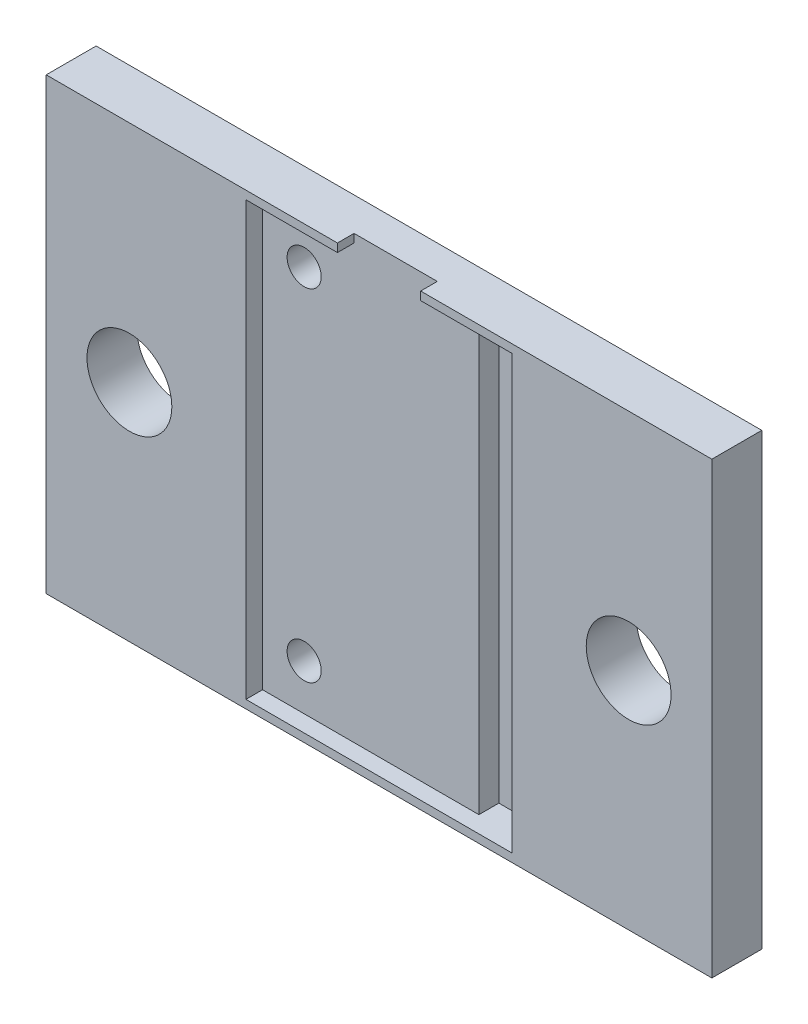
ISO-10303-21;
HEADER;
FILE_DESCRIPTION(('STEP AP214'),'2;1');
FILE_NAME('part.step','',(''),(''),'','','');
FILE_SCHEMA(('AUTOMOTIVE_DESIGN { 1 0 10303 214 1 1 1 1 }'));
ENDSEC;
DATA;
#1=APPLICATION_CONTEXT('core data for automotive mechanical design processes');
#2=APPLICATION_PROTOCOL_DEFINITION('international standard','automotive_design',2000,#1);
#3=PRODUCT_CONTEXT('',#1,'mechanical');
#4=PRODUCT('Part','Part','',(#3));
#5=PRODUCT_RELATED_PRODUCT_CATEGORY('part','',(#4));
#6=PRODUCT_DEFINITION_FORMATION('','',#4);
#7=PRODUCT_DEFINITION_CONTEXT('part definition',#1,'design');
#8=PRODUCT_DEFINITION('design','',#6,#7);
#9=PRODUCT_DEFINITION_SHAPE('','',#8);
#10=(LENGTH_UNIT() NAMED_UNIT(*) SI_UNIT(.MILLI.,.METRE.));
#11=(NAMED_UNIT(*) PLANE_ANGLE_UNIT() SI_UNIT($,.RADIAN.));
#12=(NAMED_UNIT(*) SI_UNIT($,.STERADIAN.) SOLID_ANGLE_UNIT());
#13=UNCERTAINTY_MEASURE_WITH_UNIT(LENGTH_MEASURE(1.E-05),#10,'distance_accuracy_value','');
#14=(GEOMETRIC_REPRESENTATION_CONTEXT(3) GLOBAL_UNCERTAINTY_ASSIGNED_CONTEXT((#13)) GLOBAL_UNIT_ASSIGNED_CONTEXT((#10,
#11,#12)) REPRESENTATION_CONTEXT('',''));
#15=CARTESIAN_POINT('',(0.,0.,0.));
#16=DIRECTION('',(0.,0.,1.));
#17=DIRECTION('',(1.,0.,0.));
#18=AXIS2_PLACEMENT_3D('',#15,#16,#17);
#19=CARTESIAN_POINT('',(0.,0.,3.));
#20=DIRECTION('',(0.,0.,-1.));
#21=DIRECTION('',(-1.,0.,0.));
#22=AXIS2_PLACEMENT_3D('',#19,#20,#21);
#23=PLANE('',#22);
#24=DIRECTION('',(-1.,0.,0.));
#25=VECTOR('',#24,1.);
#26=CARTESIAN_POINT('',(-8.,13.,3.));
#27=LINE('',#26,#25);
#28=CARTESIAN_POINT('',(-2.5,13.,3.));
#29=VERTEX_POINT('',#28);
#30=CARTESIAN_POINT('',(-8.,13.,3.));
#31=VERTEX_POINT('',#30);
#32=EDGE_CURVE('E235',#29,#31,#27,.T.);
#33=ORIENTED_EDGE('',*,*,#32,.F.);
#34=DIRECTION('',(0.,-1.,0.));
#35=VECTOR('',#34,1.);
#36=CARTESIAN_POINT('',(-2.5,13.,3.));
#37=LINE('',#36,#35);
#38=CARTESIAN_POINT('',(-2.5,13.5,3.));
#39=VERTEX_POINT('',#38);
#40=EDGE_CURVE('E231',#39,#29,#37,.T.);
#41=ORIENTED_EDGE('',*,*,#40,.F.);
#42=DIRECTION('',(-1.,0.,0.));
#43=VECTOR('',#42,1.);
#44=CARTESIAN_POINT('',(-20.,13.5,3.));
#45=LINE('',#44,#43);
#46=CARTESIAN_POINT('',(-20.,13.5,3.));
#47=VERTEX_POINT('',#46);
#48=EDGE_CURVE('E287',#39,#47,#45,.T.);
#49=ORIENTED_EDGE('',*,*,#48,.T.);
#50=DIRECTION('',(0.,-1.,0.));
#51=VECTOR('',#50,1.);
#52=CARTESIAN_POINT('',(-20.,-13.5,3.));
#53=LINE('',#52,#51);
#54=CARTESIAN_POINT('',(-20.,-13.5,3.));
#55=VERTEX_POINT('',#54);
#56=EDGE_CURVE('E290',#47,#55,#53,.T.);
#57=ORIENTED_EDGE('',*,*,#56,.T.);
#58=DIRECTION('',(1.,0.,0.));
#59=VECTOR('',#58,1.);
#60=CARTESIAN_POINT('',(-20.,-13.5,3.));
#61=LINE('',#60,#59);
#62=CARTESIAN_POINT('',(20.,-13.5,3.));
#63=VERTEX_POINT('',#62);
#64=EDGE_CURVE('E64',#55,#63,#61,.T.);
#65=ORIENTED_EDGE('',*,*,#64,.T.);
#66=DIRECTION('',(0.,1.,0.));
#67=VECTOR('',#66,1.);
#68=CARTESIAN_POINT('',(20.,-13.5,3.));
#69=LINE('',#68,#67);
#70=CARTESIAN_POINT('',(20.,13.5,3.));
#71=VERTEX_POINT('',#70);
#72=EDGE_CURVE('E284',#63,#71,#69,.T.);
#73=ORIENTED_EDGE('',*,*,#72,.T.);
#74=CARTESIAN_POINT('',(2.5,13.5,3.));
#75=VERTEX_POINT('',#74);
#76=EDGE_CURVE('E92',#71,#75,#45,.T.);
#77=ORIENTED_EDGE('',*,*,#76,.T.);
#78=DIRECTION('',(0.,1.,0.));
#79=VECTOR('',#78,1.);
#80=CARTESIAN_POINT('',(2.5,13.5,3.));
#81=LINE('',#80,#79);
#82=CARTESIAN_POINT('',(2.5,13.,3.));
#83=VERTEX_POINT('',#82);
#84=EDGE_CURVE('E228',#83,#75,#81,.T.);
#85=ORIENTED_EDGE('',*,*,#84,.F.);
#86=DIRECTION('',(-1.,0.,0.));
#87=VECTOR('',#86,1.);
#88=CARTESIAN_POINT('',(2.5,13.,3.));
#89=LINE('',#88,#87);
#90=CARTESIAN_POINT('',(8.,13.,3.));
#91=VERTEX_POINT('',#90);
#92=EDGE_CURVE('E198',#91,#83,#89,.T.);
#93=ORIENTED_EDGE('',*,*,#92,.F.);
#94=DIRECTION('',(0.,1.,0.));
#95=VECTOR('',#94,1.);
#96=CARTESIAN_POINT('',(8.,-13.,3.));
#97=LINE('',#96,#95);
#98=CARTESIAN_POINT('',(8.,-13.,3.));
#99=VERTEX_POINT('',#98);
#100=EDGE_CURVE('E159',#99,#91,#97,.T.);
#101=ORIENTED_EDGE('',*,*,#100,.F.);
#102=DIRECTION('',(1.,0.,0.));
#103=VECTOR('',#102,1.);
#104=CARTESIAN_POINT('',(-8.,-13.,3.));
#105=LINE('',#104,#103);
#106=CARTESIAN_POINT('',(-8.,-13.,3.));
#107=VERTEX_POINT('',#106);
#108=EDGE_CURVE('E243',#107,#99,#105,.T.);
#109=ORIENTED_EDGE('',*,*,#108,.F.);
#110=DIRECTION('',(0.,-1.,0.));
#111=VECTOR('',#110,1.);
#112=CARTESIAN_POINT('',(-8.,13.,3.));
#113=LINE('',#112,#111);
#114=EDGE_CURVE('E239',#31,#107,#113,.T.);
#115=ORIENTED_EDGE('',*,*,#114,.F.);
#116=EDGE_LOOP('',(#33,#41,#49,#57,#65,#73,#77,#85,#93,#101,#109,#115));
#117=FACE_BOUND('',#116,.T.);
#118=CARTESIAN_POINT('',(-15.,0.,3.));
#119=DIRECTION('',(0.,0.,1.));
#120=DIRECTION('',(1.,0.,0.));
#121=AXIS2_PLACEMENT_3D('',#118,#119,#120);
#122=CIRCLE('',#121,2.55);
#123=CARTESIAN_POINT('',(-12.45,0.,3.));
#124=VERTEX_POINT('',#123);
#125=EDGE_CURVE('E276',#124,#124,#122,.T.);
#126=ORIENTED_EDGE('',*,*,#125,.F.);
#127=EDGE_LOOP('',(#126));
#128=FACE_BOUND('',#127,.T.);
#129=CARTESIAN_POINT('',(15.,0.,3.));
#130=DIRECTION('',(0.,0.,1.));
#131=DIRECTION('',(-1.,0.,0.));
#132=AXIS2_PLACEMENT_3D('',#129,#130,#131);
#133=CIRCLE('',#132,2.55);
#134=CARTESIAN_POINT('',(12.45,0.,3.));
#135=VERTEX_POINT('',#134);
#136=EDGE_CURVE('E268',#135,#135,#133,.T.);
#137=ORIENTED_EDGE('',*,*,#136,.F.);
#138=EDGE_LOOP('',(#137));
#139=FACE_BOUND('',#138,.T.);
#140=ADVANCED_FACE('F39',(#117,#128,#139),#23,.F.);
#141=CARTESIAN_POINT('',(0.,0.,0.));
#142=DIRECTION('',(0.,0.,-1.));
#143=DIRECTION('',(-1.,0.,0.));
#144=AXIS2_PLACEMENT_3D('',#141,#142,#143);
#145=PLANE('',#144);
#146=CARTESIAN_POINT('',(-5.5,10.25,0.));
#147=DIRECTION('',(0.,0.,-1.));
#148=DIRECTION('',(-1.,0.,0.));
#149=AXIS2_PLACEMENT_3D('',#146,#147,#148);
#150=CIRCLE('',#149,1.025);
#151=CARTESIAN_POINT('',(-6.525,10.25,0.));
#152=VERTEX_POINT('',#151);
#153=EDGE_CURVE('E186',#152,#152,#150,.T.);
#154=ORIENTED_EDGE('',*,*,#153,.F.);
#155=EDGE_LOOP('',(#154));
#156=FACE_BOUND('',#155,.T.);
#157=CARTESIAN_POINT('',(-5.5,-10.25,0.));
#158=DIRECTION('',(0.,0.,-1.));
#159=DIRECTION('',(-1.,0.,0.));
#160=AXIS2_PLACEMENT_3D('',#157,#158,#159);
#161=CIRCLE('',#160,1.025);
#162=CARTESIAN_POINT('',(-6.525,-10.25,0.));
#163=VERTEX_POINT('',#162);
#164=EDGE_CURVE('E403',#163,#163,#161,.T.);
#165=ORIENTED_EDGE('',*,*,#164,.F.);
#166=EDGE_LOOP('',(#165));
#167=FACE_BOUND('',#166,.T.);
#168=CARTESIAN_POINT('',(-15.,0.,0.));
#169=DIRECTION('',(0.,0.,1.));
#170=DIRECTION('',(1.,0.,0.));
#171=AXIS2_PLACEMENT_3D('',#168,#169,#170);
#172=CIRCLE('',#171,2.55);
#173=CARTESIAN_POINT('',(-12.45,0.,0.));
#174=VERTEX_POINT('',#173);
#175=EDGE_CURVE('E272',#174,#174,#172,.T.);
#176=ORIENTED_EDGE('',*,*,#175,.T.);
#177=EDGE_LOOP('',(#176));
#178=FACE_BOUND('',#177,.T.);
#179=DIRECTION('',(0.,1.,0.));
#180=VECTOR('',#179,1.);
#181=CARTESIAN_POINT('',(20.,-13.5,0.));
#182=LINE('',#181,#180);
#183=CARTESIAN_POINT('',(20.,-13.5,0.));
#184=VERTEX_POINT('',#183);
#185=CARTESIAN_POINT('',(20.,13.5,0.));
#186=VERTEX_POINT('',#185);
#187=EDGE_CURVE('E280',#184,#186,#182,.T.);
#188=ORIENTED_EDGE('',*,*,#187,.F.);
#189=DIRECTION('',(1.,0.,0.));
#190=VECTOR('',#189,1.);
#191=CARTESIAN_POINT('',(-20.,-13.5,0.));
#192=LINE('',#191,#190);
#193=CARTESIAN_POINT('',(-20.,-13.5,0.));
#194=VERTEX_POINT('',#193);
#195=EDGE_CURVE('E85',#194,#184,#192,.T.);
#196=ORIENTED_EDGE('',*,*,#195,.F.);
#197=DIRECTION('',(0.,-1.,0.));
#198=VECTOR('',#197,1.);
#199=CARTESIAN_POINT('',(-20.,-13.5,0.));
#200=LINE('',#199,#198);
#201=CARTESIAN_POINT('',(-20.,13.5,0.));
#202=VERTEX_POINT('',#201);
#203=EDGE_CURVE('E302',#202,#194,#200,.T.);
#204=ORIENTED_EDGE('',*,*,#203,.F.);
#205=DIRECTION('',(-1.,0.,0.));
#206=VECTOR('',#205,1.);
#207=CARTESIAN_POINT('',(-20.,13.5,0.));
#208=LINE('',#207,#206);
#209=EDGE_CURVE('E299',#186,#202,#208,.T.);
#210=ORIENTED_EDGE('',*,*,#209,.F.);
#211=EDGE_LOOP('',(#188,#196,#204,#210));
#212=FACE_BOUND('',#211,.T.);
#213=CARTESIAN_POINT('',(15.,0.,0.));
#214=DIRECTION('',(0.,0.,1.));
#215=DIRECTION('',(-1.,0.,0.));
#216=AXIS2_PLACEMENT_3D('',#213,#214,#215);
#217=CIRCLE('',#216,2.55);
#218=CARTESIAN_POINT('',(12.45,0.,0.));
#219=VERTEX_POINT('',#218);
#220=EDGE_CURVE('E164',#219,#219,#217,.T.);
#221=ORIENTED_EDGE('',*,*,#220,.T.);
#222=EDGE_LOOP('',(#221));
#223=FACE_BOUND('',#222,.T.);
#224=ADVANCED_FACE('F322',(#156,#167,#178,#212,#223),#145,.T.);
#225=CARTESIAN_POINT('',(20.,-13.5,3.));
#226=DIRECTION('',(-1.,0.,0.));
#227=DIRECTION('',(0.,0.,1.));
#228=AXIS2_PLACEMENT_3D('',#225,#226,#227);
#229=PLANE('',#228);
#230=ORIENTED_EDGE('',*,*,#187,.T.);
#231=DIRECTION('',(0.,0.,-1.));
#232=VECTOR('',#231,1.);
#233=CARTESIAN_POINT('',(20.,13.5,3.));
#234=LINE('',#233,#232);
#235=EDGE_CURVE('E11',#71,#186,#234,.T.);
#236=ORIENTED_EDGE('',*,*,#235,.F.);
#237=ORIENTED_EDGE('',*,*,#72,.F.);
#238=DIRECTION('',(0.,0.,-1.));
#239=VECTOR('',#238,1.);
#240=CARTESIAN_POINT('',(20.,-13.5,3.));
#241=LINE('',#240,#239);
#242=EDGE_CURVE('E295',#63,#184,#241,.T.);
#243=ORIENTED_EDGE('',*,*,#242,.T.);
#244=EDGE_LOOP('',(#230,#236,#237,#243));
#245=FACE_BOUND('',#244,.T.);
#246=ADVANCED_FACE('F41',(#245),#229,.F.);
#247=CARTESIAN_POINT('',(-20.,13.5,3.));
#248=DIRECTION('',(0.,-1.,0.));
#249=DIRECTION('',(0.,0.,-1.));
#250=AXIS2_PLACEMENT_3D('',#247,#248,#249);
#251=PLANE('',#250);
#252=ORIENTED_EDGE('',*,*,#48,.F.);
#253=DIRECTION('',(0.,0.,1.));
#254=VECTOR('',#253,1.);
#255=CARTESIAN_POINT('',(-2.5,13.5,2.));
#256=LINE('',#255,#254);
#257=CARTESIAN_POINT('',(-2.5,13.5,2.));
#258=VERTEX_POINT('',#257);
#259=EDGE_CURVE('E260',#258,#39,#256,.T.);
#260=ORIENTED_EDGE('',*,*,#259,.F.);
#261=DIRECTION('',(-1.,0.,0.));
#262=VECTOR('',#261,1.);
#263=CARTESIAN_POINT('',(-2.5,13.5,2.));
#264=LINE('',#263,#262);
#265=CARTESIAN_POINT('',(2.5,13.5,2.));
#266=VERTEX_POINT('',#265);
#267=EDGE_CURVE('E206',#266,#258,#264,.T.);
#268=ORIENTED_EDGE('',*,*,#267,.F.);
#269=DIRECTION('',(0.,0.,1.));
#270=VECTOR('',#269,1.);
#271=CARTESIAN_POINT('',(2.5,13.5,2.));
#272=LINE('',#271,#270);
#273=EDGE_CURVE('E263',#266,#75,#272,.T.);
#274=ORIENTED_EDGE('',*,*,#273,.T.);
#275=ORIENTED_EDGE('',*,*,#76,.F.);
#276=ORIENTED_EDGE('',*,*,#235,.T.);
#277=ORIENTED_EDGE('',*,*,#209,.T.);
#278=DIRECTION('',(0.,0.,-1.));
#279=VECTOR('',#278,1.);
#280=CARTESIAN_POINT('',(-20.,13.5,3.));
#281=LINE('',#280,#279);
#282=EDGE_CURVE('E48',#47,#202,#281,.T.);
#283=ORIENTED_EDGE('',*,*,#282,.F.);
#284=EDGE_LOOP('',(#252,#260,#268,#274,#275,#276,#277,#283));
#285=FACE_BOUND('',#284,.T.);
#286=ADVANCED_FACE('F338',(#285),#251,.F.);
#287=CARTESIAN_POINT('',(-20.,-13.5,3.));
#288=DIRECTION('',(1.,0.,0.));
#289=DIRECTION('',(0.,0.,-1.));
#290=AXIS2_PLACEMENT_3D('',#287,#288,#289);
#291=PLANE('',#290);
#292=ORIENTED_EDGE('',*,*,#203,.T.);
#293=DIRECTION('',(0.,0.,-1.));
#294=VECTOR('',#293,1.);
#295=CARTESIAN_POINT('',(-20.,-13.5,3.));
#296=LINE('',#295,#294);
#297=EDGE_CURVE('E309',#55,#194,#296,.T.);
#298=ORIENTED_EDGE('',*,*,#297,.F.);
#299=ORIENTED_EDGE('',*,*,#56,.F.);
#300=ORIENTED_EDGE('',*,*,#282,.T.);
#301=EDGE_LOOP('',(#292,#298,#299,#300));
#302=FACE_BOUND('',#301,.T.);
#303=ADVANCED_FACE('F317',(#302),#291,.F.);
#304=CARTESIAN_POINT('',(-20.,-13.5,3.));
#305=DIRECTION('',(0.,1.,0.));
#306=DIRECTION('',(0.,0.,1.));
#307=AXIS2_PLACEMENT_3D('',#304,#305,#306);
#308=PLANE('',#307);
#309=ORIENTED_EDGE('',*,*,#195,.T.);
#310=ORIENTED_EDGE('',*,*,#242,.F.);
#311=ORIENTED_EDGE('',*,*,#64,.F.);
#312=ORIENTED_EDGE('',*,*,#297,.T.);
#313=EDGE_LOOP('',(#309,#310,#311,#312));
#314=FACE_BOUND('',#313,.T.);
#315=ADVANCED_FACE('F327',(#314),#308,.F.);
#316=CARTESIAN_POINT('',(-15.,0.,3.));
#317=DIRECTION('',(0.,0.,-1.));
#318=DIRECTION('',(-1.,0.,0.));
#319=AXIS2_PLACEMENT_3D('',#316,#317,#318);
#320=CYLINDRICAL_SURFACE('',#319,2.55);
#321=ORIENTED_EDGE('',*,*,#125,.T.);
#322=EDGE_LOOP('',(#321));
#323=FACE_BOUND('',#322,.T.);
#324=ORIENTED_EDGE('',*,*,#175,.F.);
#325=EDGE_LOOP('',(#324));
#326=FACE_BOUND('',#325,.T.);
#327=ADVANCED_FACE('F329',(#323,#326),#320,.F.);
#328=CARTESIAN_POINT('',(15.,0.,3.));
#329=DIRECTION('',(0.,0.,-1.));
#330=DIRECTION('',(-1.,0.,0.));
#331=AXIS2_PLACEMENT_3D('',#328,#329,#330);
#332=CYLINDRICAL_SURFACE('',#331,2.55);
#333=ORIENTED_EDGE('',*,*,#136,.T.);
#334=EDGE_LOOP('',(#333));
#335=FACE_BOUND('',#334,.T.);
#336=ORIENTED_EDGE('',*,*,#220,.F.);
#337=EDGE_LOOP('',(#336));
#338=FACE_BOUND('',#337,.T.);
#339=ADVANCED_FACE('F335',(#335,#338),#332,.F.);
#340=CARTESIAN_POINT('',(2.5,13.,2.));
#341=DIRECTION('',(0.,1.,0.));
#342=DIRECTION('',(0.,0.,1.));
#343=AXIS2_PLACEMENT_3D('',#340,#341,#342);
#344=PLANE('',#343);
#345=ORIENTED_EDGE('',*,*,#92,.T.);
#346=DIRECTION('',(0.,0.,1.));
#347=VECTOR('',#346,1.);
#348=CARTESIAN_POINT('',(2.5,13.,2.));
#349=LINE('',#348,#347);
#350=CARTESIAN_POINT('',(2.5,13.,2.));
#351=VERTEX_POINT('',#350);
#352=EDGE_CURVE('E225',#351,#83,#349,.T.);
#353=ORIENTED_EDGE('',*,*,#352,.F.);
#354=DIRECTION('',(-1.,0.,0.));
#355=VECTOR('',#354,1.);
#356=CARTESIAN_POINT('',(2.5,13.,2.));
#357=LINE('',#356,#355);
#358=CARTESIAN_POINT('',(5.,13.,2.));
#359=VERTEX_POINT('',#358);
#360=EDGE_CURVE('E201',#359,#351,#357,.T.);
#361=ORIENTED_EDGE('',*,*,#360,.F.);
#362=DIRECTION('',(0.,0.,1.));
#363=VECTOR('',#362,1.);
#364=CARTESIAN_POINT('',(5.,13.,0.8));
#365=LINE('',#364,#363);
#366=CARTESIAN_POINT('',(5.,13.,0.8));
#367=VERTEX_POINT('',#366);
#368=EDGE_CURVE('E171',#367,#359,#365,.T.);
#369=ORIENTED_EDGE('',*,*,#368,.F.);
#370=DIRECTION('',(-1.,0.,0.));
#371=VECTOR('',#370,1.);
#372=CARTESIAN_POINT('',(5.,13.,0.8));
#373=LINE('',#372,#371);
#374=CARTESIAN_POINT('',(8.,13.,0.8));
#375=VERTEX_POINT('',#374);
#376=EDGE_CURVE('E168',#375,#367,#373,.T.);
#377=ORIENTED_EDGE('',*,*,#376,.F.);
#378=DIRECTION('',(0.,0.,1.));
#379=VECTOR('',#378,1.);
#380=CARTESIAN_POINT('',(8.,13.,2.));
#381=LINE('',#380,#379);
#382=EDGE_CURVE('E152',#375,#91,#381,.T.);
#383=ORIENTED_EDGE('',*,*,#382,.T.);
#384=EDGE_LOOP('',(#345,#353,#361,#369,#377,#383));
#385=FACE_BOUND('',#384,.T.);
#386=ADVANCED_FACE('F169',(#385),#344,.F.);
#387=CARTESIAN_POINT('',(8.,-13.,2.));
#388=DIRECTION('',(1.,0.,0.));
#389=DIRECTION('',(0.,0.,-1.));
#390=AXIS2_PLACEMENT_3D('',#387,#388,#389);
#391=PLANE('',#390);
#392=ORIENTED_EDGE('',*,*,#100,.T.);
#393=ORIENTED_EDGE('',*,*,#382,.F.);
#394=DIRECTION('',(0.,1.,0.));
#395=VECTOR('',#394,1.);
#396=CARTESIAN_POINT('',(8.,-13.,0.8));
#397=LINE('',#396,#395);
#398=CARTESIAN_POINT('',(8.,-13.,0.8));
#399=VERTEX_POINT('',#398);
#400=EDGE_CURVE('E156',#399,#375,#397,.T.);
#401=ORIENTED_EDGE('',*,*,#400,.F.);
#402=DIRECTION('',(0.,0.,1.));
#403=VECTOR('',#402,1.);
#404=CARTESIAN_POINT('',(8.,-13.,2.));
#405=LINE('',#404,#403);
#406=EDGE_CURVE('E165',#399,#99,#405,.T.);
#407=ORIENTED_EDGE('',*,*,#406,.T.);
#408=EDGE_LOOP('',(#392,#393,#401,#407));
#409=FACE_BOUND('',#408,.T.);
#410=ADVANCED_FACE('F154',(#409),#391,.F.);
#411=CARTESIAN_POINT('',(-8.,-13.,2.));
#412=DIRECTION('',(0.,-1.,0.));
#413=DIRECTION('',(1.,0.,0.));
#414=AXIS2_PLACEMENT_3D('',#411,#412,#413);
#415=PLANE('',#414);
#416=ORIENTED_EDGE('',*,*,#108,.T.);
#417=ORIENTED_EDGE('',*,*,#406,.F.);
#418=DIRECTION('',(1.,0.,0.));
#419=VECTOR('',#418,1.);
#420=CARTESIAN_POINT('',(5.,-13.,0.8));
#421=LINE('',#420,#419);
#422=CARTESIAN_POINT('',(5.,-13.,0.8));
#423=VERTEX_POINT('',#422);
#424=EDGE_CURVE('E180',#423,#399,#421,.T.);
#425=ORIENTED_EDGE('',*,*,#424,.F.);
#426=DIRECTION('',(0.,0.,1.));
#427=VECTOR('',#426,1.);
#428=CARTESIAN_POINT('',(5.,-13.,0.8));
#429=LINE('',#428,#427);
#430=CARTESIAN_POINT('',(5.,-13.,2.));
#431=VERTEX_POINT('',#430);
#432=EDGE_CURVE('E195',#423,#431,#429,.T.);
#433=ORIENTED_EDGE('',*,*,#432,.T.);
#434=DIRECTION('',(1.,0.,0.));
#435=VECTOR('',#434,1.);
#436=CARTESIAN_POINT('',(-8.,-13.,2.));
#437=LINE('',#436,#435);
#438=CARTESIAN_POINT('',(-8.,-13.,2.));
#439=VERTEX_POINT('',#438);
#440=EDGE_CURVE('E221',#439,#431,#437,.T.);
#441=ORIENTED_EDGE('',*,*,#440,.F.);
#442=DIRECTION('',(0.,0.,1.));
#443=VECTOR('',#442,1.);
#444=CARTESIAN_POINT('',(-8.,-13.,2.));
#445=LINE('',#444,#443);
#446=EDGE_CURVE('E251',#439,#107,#445,.T.);
#447=ORIENTED_EDGE('',*,*,#446,.T.);
#448=EDGE_LOOP('',(#416,#417,#425,#433,#441,#447));
#449=FACE_BOUND('',#448,.T.);
#450=ADVANCED_FACE('F371',(#449),#415,.F.);
#451=CARTESIAN_POINT('',(-8.,13.,2.));
#452=DIRECTION('',(-1.,0.,0.));
#453=DIRECTION('',(0.,-1.,0.));
#454=AXIS2_PLACEMENT_3D('',#451,#452,#453);
#455=PLANE('',#454);
#456=ORIENTED_EDGE('',*,*,#114,.T.);
#457=ORIENTED_EDGE('',*,*,#446,.F.);
#458=DIRECTION('',(0.,-1.,0.));
#459=VECTOR('',#458,1.);
#460=CARTESIAN_POINT('',(-8.,13.,2.));
#461=LINE('',#460,#459);
#462=CARTESIAN_POINT('',(-8.,13.,2.));
#463=VERTEX_POINT('',#462);
#464=EDGE_CURVE('E217',#463,#439,#461,.T.);
#465=ORIENTED_EDGE('',*,*,#464,.F.);
#466=DIRECTION('',(0.,0.,1.));
#467=VECTOR('',#466,1.);
#468=CARTESIAN_POINT('',(-8.,13.,2.));
#469=LINE('',#468,#467);
#470=EDGE_CURVE('E254',#463,#31,#469,.T.);
#471=ORIENTED_EDGE('',*,*,#470,.T.);
#472=EDGE_LOOP('',(#456,#457,#465,#471));
#473=FACE_BOUND('',#472,.T.);
#474=ADVANCED_FACE('F367',(#473),#455,.F.);
#475=CARTESIAN_POINT('',(-8.,13.,2.));
#476=DIRECTION('',(0.,1.,0.));
#477=DIRECTION('',(-1.,0.,0.));
#478=AXIS2_PLACEMENT_3D('',#475,#476,#477);
#479=PLANE('',#478);
#480=ORIENTED_EDGE('',*,*,#32,.T.);
#481=ORIENTED_EDGE('',*,*,#470,.F.);
#482=DIRECTION('',(-1.,0.,0.));
#483=VECTOR('',#482,1.);
#484=CARTESIAN_POINT('',(-8.,13.,2.));
#485=LINE('',#484,#483);
#486=CARTESIAN_POINT('',(-2.5,13.,2.));
#487=VERTEX_POINT('',#486);
#488=EDGE_CURVE('E213',#487,#463,#485,.T.);
#489=ORIENTED_EDGE('',*,*,#488,.F.);
#490=DIRECTION('',(0.,0.,1.));
#491=VECTOR('',#490,1.);
#492=CARTESIAN_POINT('',(-2.5,13.,2.));
#493=LINE('',#492,#491);
#494=EDGE_CURVE('E257',#487,#29,#493,.T.);
#495=ORIENTED_EDGE('',*,*,#494,.T.);
#496=EDGE_LOOP('',(#480,#481,#489,#495));
#497=FACE_BOUND('',#496,.T.);
#498=ADVANCED_FACE('F363',(#497),#479,.F.);
#499=CARTESIAN_POINT('',(-2.5,13.,2.));
#500=DIRECTION('',(-1.,0.,0.));
#501=DIRECTION('',(0.,0.,1.));
#502=AXIS2_PLACEMENT_3D('',#499,#500,#501);
#503=PLANE('',#502);
#504=ORIENTED_EDGE('',*,*,#40,.T.);
#505=ORIENTED_EDGE('',*,*,#494,.F.);
#506=DIRECTION('',(0.,-1.,0.));
#507=VECTOR('',#506,1.);
#508=CARTESIAN_POINT('',(-2.5,13.,2.));
#509=LINE('',#508,#507);
#510=EDGE_CURVE('E209',#258,#487,#509,.T.);
#511=ORIENTED_EDGE('',*,*,#510,.F.);
#512=ORIENTED_EDGE('',*,*,#259,.T.);
#513=EDGE_LOOP('',(#504,#505,#511,#512));
#514=FACE_BOUND('',#513,.T.);
#515=ADVANCED_FACE('F359',(#514),#503,.F.);
#516=CARTESIAN_POINT('',(2.5,13.5,2.));
#517=DIRECTION('',(1.,0.,0.));
#518=DIRECTION('',(0.,0.,-1.));
#519=AXIS2_PLACEMENT_3D('',#516,#517,#518);
#520=PLANE('',#519);
#521=ORIENTED_EDGE('',*,*,#84,.T.);
#522=ORIENTED_EDGE('',*,*,#273,.F.);
#523=DIRECTION('',(0.,1.,0.));
#524=VECTOR('',#523,1.);
#525=CARTESIAN_POINT('',(2.5,13.5,2.));
#526=LINE('',#525,#524);
#527=EDGE_CURVE('E55',#351,#266,#526,.T.);
#528=ORIENTED_EDGE('',*,*,#527,.F.);
#529=ORIENTED_EDGE('',*,*,#352,.T.);
#530=EDGE_LOOP('',(#521,#522,#528,#529));
#531=FACE_BOUND('',#530,.T.);
#532=ADVANCED_FACE('F355',(#531),#520,.F.);
#533=CARTESIAN_POINT('',(0.,0.,2.));
#534=DIRECTION('',(0.,0.,1.));
#535=DIRECTION('',(1.,0.,0.));
#536=AXIS2_PLACEMENT_3D('',#533,#534,#535);
#537=PLANE('',#536);
#538=CARTESIAN_POINT('',(-5.5,10.25,2.));
#539=DIRECTION('',(0.,0.,1.));
#540=DIRECTION('',(1.,0.,0.));
#541=AXIS2_PLACEMENT_3D('',#538,#539,#540);
#542=CIRCLE('',#541,1.025);
#543=CARTESIAN_POINT('',(-4.475,10.25,2.));
#544=VERTEX_POINT('',#543);
#545=EDGE_CURVE('E401',#544,#544,#542,.T.);
#546=ORIENTED_EDGE('',*,*,#545,.F.);
#547=EDGE_LOOP('',(#546));
#548=FACE_BOUND('',#547,.T.);
#549=CARTESIAN_POINT('',(-5.5,-10.25,2.));
#550=DIRECTION('',(0.,0.,1.));
#551=DIRECTION('',(1.,0.,0.));
#552=AXIS2_PLACEMENT_3D('',#549,#550,#551);
#553=CIRCLE('',#552,1.025);
#554=CARTESIAN_POINT('',(-4.475,-10.25,2.));
#555=VERTEX_POINT('',#554);
#556=EDGE_CURVE('E404',#555,#555,#553,.T.);
#557=ORIENTED_EDGE('',*,*,#556,.F.);
#558=EDGE_LOOP('',(#557));
#559=FACE_BOUND('',#558,.T.);
#560=DIRECTION('',(0.,-1.,0.));
#561=VECTOR('',#560,1.);
#562=CARTESIAN_POINT('',(5.,-13.,2.));
#563=LINE('',#562,#561);
#564=EDGE_CURVE('E182',#359,#431,#563,.T.);
#565=ORIENTED_EDGE('',*,*,#564,.F.);
#566=ORIENTED_EDGE('',*,*,#360,.T.);
#567=ORIENTED_EDGE('',*,*,#527,.T.);
#568=ORIENTED_EDGE('',*,*,#267,.T.);
#569=ORIENTED_EDGE('',*,*,#510,.T.);
#570=ORIENTED_EDGE('',*,*,#488,.T.);
#571=ORIENTED_EDGE('',*,*,#464,.T.);
#572=ORIENTED_EDGE('',*,*,#440,.T.);
#573=EDGE_LOOP('',(#565,#566,#567,#568,#569,#570,#571,#572));
#574=FACE_BOUND('',#573,.T.);
#575=ADVANCED_FACE('F358',(#548,#559,#574),#537,.T.);
#576=CARTESIAN_POINT('',(5.,-13.,0.8));
#577=DIRECTION('',(-1.,0.,0.));
#578=DIRECTION('',(0.,0.,1.));
#579=AXIS2_PLACEMENT_3D('',#576,#577,#578);
#580=PLANE('',#579);
#581=ORIENTED_EDGE('',*,*,#564,.T.);
#582=ORIENTED_EDGE('',*,*,#432,.F.);
#583=DIRECTION('',(0.,-1.,0.));
#584=VECTOR('',#583,1.);
#585=CARTESIAN_POINT('',(5.,-13.,0.8));
#586=LINE('',#585,#584);
#587=EDGE_CURVE('E176',#367,#423,#586,.T.);
#588=ORIENTED_EDGE('',*,*,#587,.F.);
#589=ORIENTED_EDGE('',*,*,#368,.T.);
#590=EDGE_LOOP('',(#581,#582,#588,#589));
#591=FACE_BOUND('',#590,.T.);
#592=ADVANCED_FACE('F380',(#591),#580,.F.);
#593=CARTESIAN_POINT('',(0.,0.,0.8));
#594=DIRECTION('',(0.,0.,-1.));
#595=DIRECTION('',(-1.,0.,0.));
#596=AXIS2_PLACEMENT_3D('',#593,#594,#595);
#597=PLANE('',#596);
#598=ORIENTED_EDGE('',*,*,#400,.T.);
#599=ORIENTED_EDGE('',*,*,#376,.T.);
#600=ORIENTED_EDGE('',*,*,#587,.T.);
#601=ORIENTED_EDGE('',*,*,#424,.T.);
#602=EDGE_LOOP('',(#598,#599,#600,#601));
#603=FACE_BOUND('',#602,.T.);
#604=ADVANCED_FACE('F178',(#603),#597,.F.);
#605=CARTESIAN_POINT('',(-5.5,-10.25,-1.));
#606=DIRECTION('',(0.,0.,1.));
#607=DIRECTION('',(1.,0.,0.));
#608=AXIS2_PLACEMENT_3D('',#605,#606,#607);
#609=CYLINDRICAL_SURFACE('',#608,1.025);
#610=ORIENTED_EDGE('',*,*,#164,.T.);
#611=EDGE_LOOP('',(#610));
#612=FACE_BOUND('',#611,.T.);
#613=ORIENTED_EDGE('',*,*,#556,.T.);
#614=EDGE_LOOP('',(#613));
#615=FACE_BOUND('',#614,.T.);
#616=ADVANCED_FACE('F387',(#612,#615),#609,.F.);
#617=CARTESIAN_POINT('',(-5.5,10.25,-1.));
#618=DIRECTION('',(0.,0.,1.));
#619=DIRECTION('',(1.,0.,0.));
#620=AXIS2_PLACEMENT_3D('',#617,#618,#619);
#621=CYLINDRICAL_SURFACE('',#620,1.025);
#622=ORIENTED_EDGE('',*,*,#153,.T.);
#623=EDGE_LOOP('',(#622));
#624=FACE_BOUND('',#623,.T.);
#625=ORIENTED_EDGE('',*,*,#545,.T.);
#626=EDGE_LOOP('',(#625));
#627=FACE_BOUND('',#626,.T.);
#628=ADVANCED_FACE('F390',(#624,#627),#621,.F.);
#629=CLOSED_SHELL('',(#140,#224,#246,#286,#303,#315,#327,#339,#386,#410,#450,#474,#498,#515,
#532,#575,#592,#604,#616,#628));
#630=MANIFOLD_SOLID_BREP('B2',#629);
#631=ADVANCED_BREP_SHAPE_REPRESENTATION('',(#18,#630),#14);
#632=SHAPE_DEFINITION_REPRESENTATION(#9,#631);
ENDSEC;
END-ISO-10303-21;
